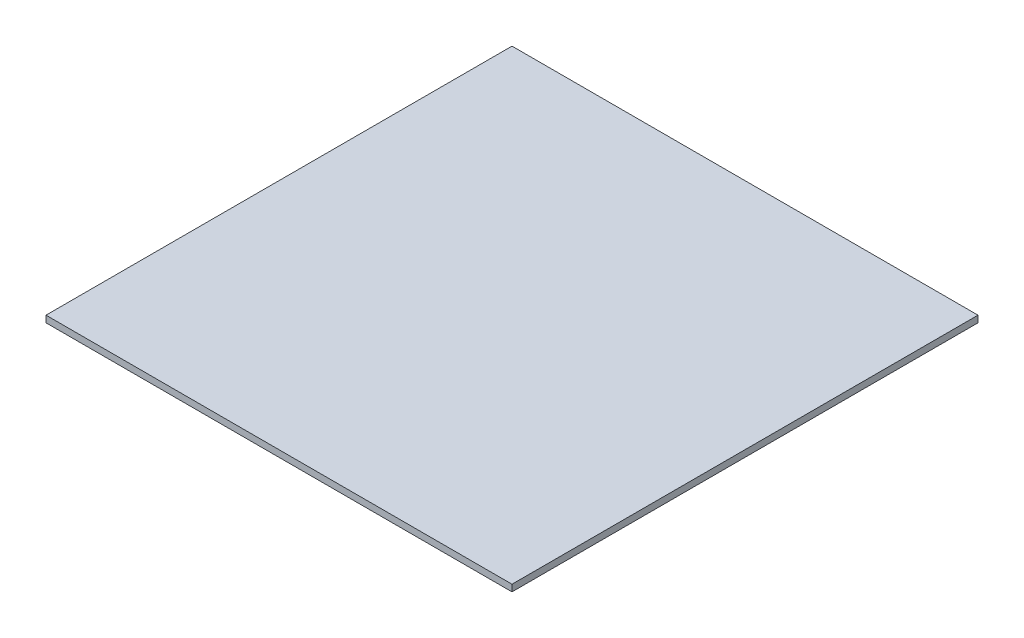
ISO-10303-21;
HEADER;
FILE_DESCRIPTION(('STEP AP214'),'2;1');
FILE_NAME('part.step','',(''),(''),'','','');
FILE_SCHEMA(('AUTOMOTIVE_DESIGN { 1 0 10303 214 1 1 1 1 }'));
ENDSEC;
DATA;
#1=APPLICATION_CONTEXT('core data for automotive mechanical design processes');
#2=APPLICATION_PROTOCOL_DEFINITION('international standard','automotive_design',2000,#1);
#3=PRODUCT_CONTEXT('',#1,'mechanical');
#4=PRODUCT('Part','Part','',(#3));
#5=PRODUCT_RELATED_PRODUCT_CATEGORY('part','',(#4));
#6=PRODUCT_DEFINITION_FORMATION('','',#4);
#7=PRODUCT_DEFINITION_CONTEXT('part definition',#1,'design');
#8=PRODUCT_DEFINITION('design','',#6,#7);
#9=PRODUCT_DEFINITION_SHAPE('','',#8);
#10=(LENGTH_UNIT() NAMED_UNIT(*) SI_UNIT(.MILLI.,.METRE.));
#11=(NAMED_UNIT(*) PLANE_ANGLE_UNIT() SI_UNIT($,.RADIAN.));
#12=(NAMED_UNIT(*) SI_UNIT($,.STERADIAN.) SOLID_ANGLE_UNIT());
#13=UNCERTAINTY_MEASURE_WITH_UNIT(LENGTH_MEASURE(1.E-05),#10,'distance_accuracy_value','');
#14=(GEOMETRIC_REPRESENTATION_CONTEXT(3) GLOBAL_UNCERTAINTY_ASSIGNED_CONTEXT((#13)) GLOBAL_UNIT_ASSIGNED_CONTEXT((#10,
#11,#12)) REPRESENTATION_CONTEXT('',''));
#15=CARTESIAN_POINT('',(0.,0.,0.));
#16=DIRECTION('',(0.,0.,1.));
#17=DIRECTION('',(1.,0.,0.));
#18=AXIS2_PLACEMENT_3D('',#15,#16,#17);
#19=CARTESIAN_POINT('',(0.,12.7,0.));
#20=DIRECTION('',(1.,0.,0.));
#21=DIRECTION('',(0.,0.,-1.));
#22=AXIS2_PLACEMENT_3D('',#19,#20,#21);
#23=PLANE('',#22);
#24=DIRECTION('',(0.,0.,1.));
#25=VECTOR('',#24,1.);
#26=CARTESIAN_POINT('',(0.,0.,0.));
#27=LINE('',#26,#25);
#28=CARTESIAN_POINT('',(0.,0.,-889.));
#29=VERTEX_POINT('',#28);
#30=CARTESIAN_POINT('',(0.,0.,0.));
#31=VERTEX_POINT('',#30);
#32=EDGE_CURVE('E107',#29,#31,#27,.T.);
#33=ORIENTED_EDGE('',*,*,#32,.T.);
#34=DIRECTION('',(0.,-1.,0.));
#35=VECTOR('',#34,1.);
#36=CARTESIAN_POINT('',(0.,12.7,0.));
#37=LINE('',#36,#35);
#38=CARTESIAN_POINT('',(0.,12.7,0.));
#39=VERTEX_POINT('',#38);
#40=EDGE_CURVE('E11',#39,#31,#37,.T.);
#41=ORIENTED_EDGE('',*,*,#40,.F.);
#42=DIRECTION('',(0.,0.,1.));
#43=VECTOR('',#42,1.);
#44=CARTESIAN_POINT('',(0.,12.7,0.));
#45=LINE('',#44,#43);
#46=CARTESIAN_POINT('',(0.,12.7,-889.));
#47=VERTEX_POINT('',#46);
#48=EDGE_CURVE('E91',#47,#39,#45,.T.);
#49=ORIENTED_EDGE('',*,*,#48,.F.);
#50=DIRECTION('',(0.,-1.,0.));
#51=VECTOR('',#50,1.);
#52=CARTESIAN_POINT('',(0.,12.7,-889.));
#53=LINE('',#52,#51);
#54=EDGE_CURVE('E103',#47,#29,#53,.T.);
#55=ORIENTED_EDGE('',*,*,#54,.T.);
#56=EDGE_LOOP('',(#33,#41,#49,#55));
#57=FACE_BOUND('',#56,.T.);
#58=ADVANCED_FACE('F39',(#57),#23,.F.);
#59=CARTESIAN_POINT('',(0.,12.7,0.));
#60=DIRECTION('',(0.,0.,-1.));
#61=DIRECTION('',(-1.,0.,0.));
#62=AXIS2_PLACEMENT_3D('',#59,#60,#61);
#63=PLANE('',#62);
#64=DIRECTION('',(1.,0.,0.));
#65=VECTOR('',#64,1.);
#66=CARTESIAN_POINT('',(0.,0.,0.));
#67=LINE('',#66,#65);
#68=CARTESIAN_POINT('',(889.,0.,0.));
#69=VERTEX_POINT('',#68);
#70=EDGE_CURVE('E96',#31,#69,#67,.T.);
#71=ORIENTED_EDGE('',*,*,#70,.T.);
#72=DIRECTION('',(0.,-1.,0.));
#73=VECTOR('',#72,1.);
#74=CARTESIAN_POINT('',(889.,12.7,0.));
#75=LINE('',#74,#73);
#76=CARTESIAN_POINT('',(889.,12.7,0.));
#77=VERTEX_POINT('',#76);
#78=EDGE_CURVE('E48',#77,#69,#75,.T.);
#79=ORIENTED_EDGE('',*,*,#78,.F.);
#80=DIRECTION('',(1.,0.,0.));
#81=VECTOR('',#80,1.);
#82=CARTESIAN_POINT('',(0.,12.7,0.));
#83=LINE('',#82,#81);
#84=EDGE_CURVE('E86',#39,#77,#83,.T.);
#85=ORIENTED_EDGE('',*,*,#84,.F.);
#86=ORIENTED_EDGE('',*,*,#40,.T.);
#87=EDGE_LOOP('',(#71,#79,#85,#86));
#88=FACE_BOUND('',#87,.T.);
#89=ADVANCED_FACE('F95',(#88),#63,.F.);
#90=CARTESIAN_POINT('',(889.,12.7,0.));
#91=DIRECTION('',(-1.,0.,0.));
#92=DIRECTION('',(0.,0.,1.));
#93=AXIS2_PLACEMENT_3D('',#90,#91,#92);
#94=PLANE('',#93);
#95=DIRECTION('',(0.,0.,-1.));
#96=VECTOR('',#95,1.);
#97=CARTESIAN_POINT('',(889.,0.,0.));
#98=LINE('',#97,#96);
#99=CARTESIAN_POINT('',(889.,0.,-889.));
#100=VERTEX_POINT('',#99);
#101=EDGE_CURVE('E73',#69,#100,#98,.T.);
#102=ORIENTED_EDGE('',*,*,#101,.T.);
#103=DIRECTION('',(0.,-1.,0.));
#104=VECTOR('',#103,1.);
#105=CARTESIAN_POINT('',(889.,12.7,-889.));
#106=LINE('',#105,#104);
#107=CARTESIAN_POINT('',(889.,12.7,-889.));
#108=VERTEX_POINT('',#107);
#109=EDGE_CURVE('E98',#108,#100,#106,.T.);
#110=ORIENTED_EDGE('',*,*,#109,.F.);
#111=DIRECTION('',(0.,0.,-1.));
#112=VECTOR('',#111,1.);
#113=CARTESIAN_POINT('',(889.,12.7,0.));
#114=LINE('',#113,#112);
#115=EDGE_CURVE('E89',#77,#108,#114,.T.);
#116=ORIENTED_EDGE('',*,*,#115,.F.);
#117=ORIENTED_EDGE('',*,*,#78,.T.);
#118=EDGE_LOOP('',(#102,#110,#116,#117));
#119=FACE_BOUND('',#118,.T.);
#120=ADVANCED_FACE('F99',(#119),#94,.F.);
#121=CARTESIAN_POINT('',(0.,12.7,-889.));
#122=DIRECTION('',(0.,0.,1.));
#123=DIRECTION('',(1.,0.,0.));
#124=AXIS2_PLACEMENT_3D('',#121,#122,#123);
#125=PLANE('',#124);
#126=DIRECTION('',(-1.,0.,0.));
#127=VECTOR('',#126,1.);
#128=CARTESIAN_POINT('',(0.,0.,-889.));
#129=LINE('',#128,#127);
#130=EDGE_CURVE('E79',#100,#29,#129,.T.);
#131=ORIENTED_EDGE('',*,*,#130,.T.);
#132=ORIENTED_EDGE('',*,*,#54,.F.);
#133=DIRECTION('',(-1.,0.,0.));
#134=VECTOR('',#133,1.);
#135=CARTESIAN_POINT('',(0.,12.7,-889.));
#136=LINE('',#135,#134);
#137=EDGE_CURVE('E56',#108,#47,#136,.T.);
#138=ORIENTED_EDGE('',*,*,#137,.F.);
#139=ORIENTED_EDGE('',*,*,#109,.T.);
#140=EDGE_LOOP('',(#131,#132,#138,#139));
#141=FACE_BOUND('',#140,.T.);
#142=ADVANCED_FACE('F120',(#141),#125,.F.);
#143=CARTESIAN_POINT('',(0.,12.7,0.));
#144=DIRECTION('',(0.,-1.,0.));
#145=DIRECTION('',(0.,0.,-1.));
#146=AXIS2_PLACEMENT_3D('',#143,#144,#145);
#147=PLANE('',#146);
#148=ORIENTED_EDGE('',*,*,#48,.T.);
#149=ORIENTED_EDGE('',*,*,#84,.T.);
#150=ORIENTED_EDGE('',*,*,#115,.T.);
#151=ORIENTED_EDGE('',*,*,#137,.T.);
#152=EDGE_LOOP('',(#148,#149,#150,#151));
#153=FACE_BOUND('',#152,.T.);
#154=ADVANCED_FACE('F87',(#153),#147,.F.);
#155=CARTESIAN_POINT('',(0.,0.,0.));
#156=DIRECTION('',(0.,-1.,0.));
#157=DIRECTION('',(0.,0.,-1.));
#158=AXIS2_PLACEMENT_3D('',#155,#156,#157);
#159=PLANE('',#158);
#160=ORIENTED_EDGE('',*,*,#32,.F.);
#161=ORIENTED_EDGE('',*,*,#130,.F.);
#162=ORIENTED_EDGE('',*,*,#101,.F.);
#163=ORIENTED_EDGE('',*,*,#70,.F.);
#164=EDGE_LOOP('',(#160,#161,#162,#163));
#165=FACE_BOUND('',#164,.T.);
#166=ADVANCED_FACE('F123',(#165),#159,.T.);
#167=CLOSED_SHELL('',(#58,#89,#120,#142,#154,#166));
#168=MANIFOLD_SOLID_BREP('B2',#167);
#169=ADVANCED_BREP_SHAPE_REPRESENTATION('',(#18,#168),#14);
#170=SHAPE_DEFINITION_REPRESENTATION(#9,#169);
ENDSEC;
END-ISO-10303-21;
